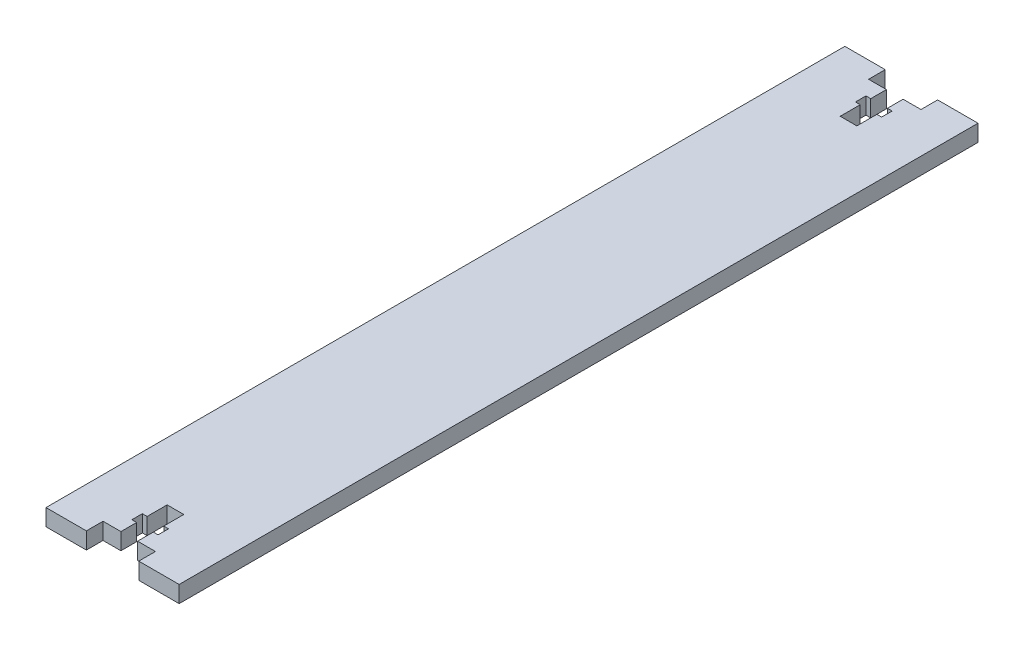
ISO-10303-21;
HEADER;
FILE_DESCRIPTION(('STEP AP214'),'2;1');
FILE_NAME('part.step','',(''),(''),'','','');
FILE_SCHEMA(('AUTOMOTIVE_DESIGN { 1 0 10303 214 1 1 1 1 }'));
ENDSEC;
DATA;
#1=APPLICATION_CONTEXT('core data for automotive mechanical design processes');
#2=APPLICATION_PROTOCOL_DEFINITION('international standard','automotive_design',2000,#1);
#3=PRODUCT_CONTEXT('',#1,'mechanical');
#4=PRODUCT('Part','Part','',(#3));
#5=PRODUCT_RELATED_PRODUCT_CATEGORY('part','',(#4));
#6=PRODUCT_DEFINITION_FORMATION('','',#4);
#7=PRODUCT_DEFINITION_CONTEXT('part definition',#1,'design');
#8=PRODUCT_DEFINITION('design','',#6,#7);
#9=PRODUCT_DEFINITION_SHAPE('','',#8);
#10=(LENGTH_UNIT() NAMED_UNIT(*) SI_UNIT(.MILLI.,.METRE.));
#11=(NAMED_UNIT(*) PLANE_ANGLE_UNIT() SI_UNIT($,.RADIAN.));
#12=(NAMED_UNIT(*) SI_UNIT($,.STERADIAN.) SOLID_ANGLE_UNIT());
#13=UNCERTAINTY_MEASURE_WITH_UNIT(LENGTH_MEASURE(1.E-05),#10,'distance_accuracy_value','');
#14=(GEOMETRIC_REPRESENTATION_CONTEXT(3) GLOBAL_UNCERTAINTY_ASSIGNED_CONTEXT((#13)) GLOBAL_UNIT_ASSIGNED_CONTEXT((#10,
#11,#12)) REPRESENTATION_CONTEXT('',''));
#15=CARTESIAN_POINT('',(0.,0.,0.));
#16=DIRECTION('',(0.,0.,1.));
#17=DIRECTION('',(1.,0.,0.));
#18=AXIS2_PLACEMENT_3D('',#15,#16,#17);
#19=CARTESIAN_POINT('',(12.7,3.18,76.2));
#20=DIRECTION('',(0.,0.,-1.));
#21=DIRECTION('',(-1.,0.,0.));
#22=AXIS2_PLACEMENT_3D('',#19,#20,#21);
#23=PLANE('',#22);
#24=DIRECTION('',(0.,1.,0.));
#25=VECTOR('',#24,1.);
#26=CARTESIAN_POINT('',(-4.99999999999998,0.,76.2));
#27=LINE('',#26,#25);
#28=CARTESIAN_POINT('',(-4.99999999999998,0.,76.2));
#29=VERTEX_POINT('',#28);
#30=CARTESIAN_POINT('',(-4.99999999999998,3.18,76.2));
#31=VERTEX_POINT('',#30);
#32=EDGE_CURVE('E570',#29,#31,#27,.T.);
#33=ORIENTED_EDGE('',*,*,#32,.T.);
#34=DIRECTION('',(1.,0.,0.));
#35=VECTOR('',#34,1.);
#36=CARTESIAN_POINT('',(12.7,3.18,76.2));
#37=LINE('',#36,#35);
#38=CARTESIAN_POINT('',(-12.7,3.18,76.2));
#39=VERTEX_POINT('',#38);
#40=EDGE_CURVE('E709',#39,#31,#37,.T.);
#41=ORIENTED_EDGE('',*,*,#40,.F.);
#42=DIRECTION('',(0.,-1.,0.));
#43=VECTOR('',#42,1.);
#44=CARTESIAN_POINT('',(-12.7,3.18,76.2));
#45=LINE('',#44,#43);
#46=CARTESIAN_POINT('',(-12.7,0.,76.2));
#47=VERTEX_POINT('',#46);
#48=EDGE_CURVE('E12',#39,#47,#45,.T.);
#49=ORIENTED_EDGE('',*,*,#48,.T.);
#50=DIRECTION('',(1.,0.,0.));
#51=VECTOR('',#50,1.);
#52=CARTESIAN_POINT('',(12.7,0.,76.2));
#53=LINE('',#52,#51);
#54=EDGE_CURVE('E726',#47,#29,#53,.T.);
#55=ORIENTED_EDGE('',*,*,#54,.T.);
#56=EDGE_LOOP('',(#33,#41,#49,#55));
#57=FACE_BOUND('',#56,.T.);
#58=ADVANCED_FACE('F138',(#57),#23,.F.);
#59=CARTESIAN_POINT('',(12.7,3.18,-76.2));
#60=DIRECTION('',(0.,0.,1.));
#61=DIRECTION('',(1.,0.,0.));
#62=AXIS2_PLACEMENT_3D('',#59,#60,#61);
#63=PLANE('',#62);
#64=DIRECTION('',(0.,1.,0.));
#65=VECTOR('',#64,1.);
#66=CARTESIAN_POINT('',(4.99999999999999,0.,-76.2));
#67=LINE('',#66,#65);
#68=CARTESIAN_POINT('',(4.99999999999999,0.,-76.2));
#69=VERTEX_POINT('',#68);
#70=CARTESIAN_POINT('',(4.99999999999999,3.18,-76.2));
#71=VERTEX_POINT('',#70);
#72=EDGE_CURVE('E526',#69,#71,#67,.T.);
#73=ORIENTED_EDGE('',*,*,#72,.T.);
#74=DIRECTION('',(-1.,0.,0.));
#75=VECTOR('',#74,1.);
#76=CARTESIAN_POINT('',(12.7,3.18,-76.2));
#77=LINE('',#76,#75);
#78=CARTESIAN_POINT('',(12.7,3.18,-76.2));
#79=VERTEX_POINT('',#78);
#80=EDGE_CURVE('E717',#79,#71,#77,.T.);
#81=ORIENTED_EDGE('',*,*,#80,.F.);
#82=DIRECTION('',(0.,-1.,0.));
#83=VECTOR('',#82,1.);
#84=CARTESIAN_POINT('',(12.7,3.18,-76.2));
#85=LINE('',#84,#83);
#86=CARTESIAN_POINT('',(12.7,0.,-76.2));
#87=VERTEX_POINT('',#86);
#88=EDGE_CURVE('E740',#79,#87,#85,.T.);
#89=ORIENTED_EDGE('',*,*,#88,.T.);
#90=DIRECTION('',(-1.,0.,0.));
#91=VECTOR('',#90,1.);
#92=CARTESIAN_POINT('',(12.7,0.,-76.2));
#93=LINE('',#92,#91);
#94=EDGE_CURVE('E708',#87,#69,#93,.T.);
#95=ORIENTED_EDGE('',*,*,#94,.T.);
#96=EDGE_LOOP('',(#73,#81,#89,#95));
#97=FACE_BOUND('',#96,.T.);
#98=ADVANCED_FACE('F757',(#97),#63,.F.);
#99=CARTESIAN_POINT('',(-12.7,3.18,-76.2));
#100=DIRECTION('',(1.,0.,0.));
#101=DIRECTION('',(0.,0.,-1.));
#102=AXIS2_PLACEMENT_3D('',#99,#100,#101);
#103=PLANE('',#102);
#104=DIRECTION('',(0.,0.,1.));
#105=VECTOR('',#104,1.);
#106=CARTESIAN_POINT('',(-12.7,0.,-76.2));
#107=LINE('',#106,#105);
#108=CARTESIAN_POINT('',(-12.7,0.,-76.2));
#109=VERTEX_POINT('',#108);
#110=EDGE_CURVE('E504',#109,#47,#107,.T.);
#111=ORIENTED_EDGE('',*,*,#110,.T.);
#112=ORIENTED_EDGE('',*,*,#48,.F.);
#113=DIRECTION('',(0.,0.,1.));
#114=VECTOR('',#113,1.);
#115=CARTESIAN_POINT('',(-12.7,3.18,-76.2));
#116=LINE('',#115,#114);
#117=CARTESIAN_POINT('',(-12.7,3.18,-76.2));
#118=VERTEX_POINT('',#117);
#119=EDGE_CURVE('E703',#118,#39,#116,.T.);
#120=ORIENTED_EDGE('',*,*,#119,.F.);
#121=DIRECTION('',(0.,-1.,0.));
#122=VECTOR('',#121,1.);
#123=CARTESIAN_POINT('',(-12.7,3.18,-76.2));
#124=LINE('',#123,#122);
#125=EDGE_CURVE('E721',#118,#109,#124,.T.);
#126=ORIENTED_EDGE('',*,*,#125,.T.);
#127=EDGE_LOOP('',(#111,#112,#120,#126));
#128=FACE_BOUND('',#127,.T.);
#129=ADVANCED_FACE('F140',(#128),#103,.F.);
#130=CARTESIAN_POINT('',(5.00000000000001,3.18,76.2));
#131=VERTEX_POINT('',#130);
#132=CARTESIAN_POINT('',(12.7,3.18,76.2));
#133=VERTEX_POINT('',#132);
#134=EDGE_CURVE('E707',#131,#133,#37,.T.);
#135=ORIENTED_EDGE('',*,*,#134,.F.);
#136=DIRECTION('',(0.,1.,0.));
#137=VECTOR('',#136,1.);
#138=CARTESIAN_POINT('',(5.00000000000001,0.,76.2));
#139=LINE('',#138,#137);
#140=CARTESIAN_POINT('',(5.00000000000001,0.,76.2));
#141=VERTEX_POINT('',#140);
#142=EDGE_CURVE('E567',#141,#131,#139,.T.);
#143=ORIENTED_EDGE('',*,*,#142,.F.);
#144=CARTESIAN_POINT('',(12.7,0.,76.2));
#145=VERTEX_POINT('',#144);
#146=EDGE_CURVE('E725',#141,#145,#53,.T.);
#147=ORIENTED_EDGE('',*,*,#146,.T.);
#148=DIRECTION('',(0.,-1.,0.));
#149=VECTOR('',#148,1.);
#150=CARTESIAN_POINT('',(12.7,3.18,76.2));
#151=LINE('',#150,#149);
#152=EDGE_CURVE('E147',#133,#145,#151,.T.);
#153=ORIENTED_EDGE('',*,*,#152,.F.);
#154=EDGE_LOOP('',(#135,#143,#147,#153));
#155=FACE_BOUND('',#154,.T.);
#156=ADVANCED_FACE('F768',(#155),#23,.F.);
#157=CARTESIAN_POINT('',(12.7,3.18,-76.2));
#158=DIRECTION('',(-1.,0.,0.));
#159=DIRECTION('',(0.,0.,1.));
#160=AXIS2_PLACEMENT_3D('',#157,#158,#159);
#161=PLANE('',#160);
#162=DIRECTION('',(0.,0.,-1.));
#163=VECTOR('',#162,1.);
#164=CARTESIAN_POINT('',(12.7,0.,-76.2));
#165=LINE('',#164,#163);
#166=EDGE_CURVE('E730',#145,#87,#165,.T.);
#167=ORIENTED_EDGE('',*,*,#166,.T.);
#168=ORIENTED_EDGE('',*,*,#88,.F.);
#169=DIRECTION('',(0.,0.,-1.));
#170=VECTOR('',#169,1.);
#171=CARTESIAN_POINT('',(12.7,3.18,-76.2));
#172=LINE('',#171,#170);
#173=EDGE_CURVE('E713',#133,#79,#172,.T.);
#174=ORIENTED_EDGE('',*,*,#173,.F.);
#175=ORIENTED_EDGE('',*,*,#152,.T.);
#176=EDGE_LOOP('',(#167,#168,#174,#175));
#177=FACE_BOUND('',#176,.T.);
#178=ADVANCED_FACE('F749',(#177),#161,.F.);
#179=CARTESIAN_POINT('',(-5.,3.18,-76.2));
#180=VERTEX_POINT('',#179);
#181=EDGE_CURVE('E716',#180,#118,#77,.T.);
#182=ORIENTED_EDGE('',*,*,#181,.F.);
#183=DIRECTION('',(0.,1.,0.));
#184=VECTOR('',#183,1.);
#185=CARTESIAN_POINT('',(-5.,0.,-76.2));
#186=LINE('',#185,#184);
#187=CARTESIAN_POINT('',(-5.,0.,-76.2));
#188=VERTEX_POINT('',#187);
#189=EDGE_CURVE('E523',#188,#180,#186,.T.);
#190=ORIENTED_EDGE('',*,*,#189,.F.);
#191=EDGE_CURVE('E733',#188,#109,#93,.T.);
#192=ORIENTED_EDGE('',*,*,#191,.T.);
#193=ORIENTED_EDGE('',*,*,#125,.F.);
#194=EDGE_LOOP('',(#182,#190,#192,#193));
#195=FACE_BOUND('',#194,.T.);
#196=ADVANCED_FACE('F844',(#195),#63,.F.);
#197=CARTESIAN_POINT('',(0.,3.18,0.));
#198=DIRECTION('',(0.,-1.,0.));
#199=DIRECTION('',(0.,0.,-1.));
#200=AXIS2_PLACEMENT_3D('',#197,#198,#199);
#201=PLANE('',#200);
#202=DIRECTION('',(1.,0.,0.));
#203=VECTOR('',#202,1.);
#204=CARTESIAN_POINT('',(0.,3.18,-73.02));
#205=LINE('',#204,#203);
#206=CARTESIAN_POINT('',(-5.,3.18,-73.02));
#207=VERTEX_POINT('',#206);
#208=CARTESIAN_POINT('',(-1.59000000000001,3.18,-73.02));
#209=VERTEX_POINT('',#208);
#210=EDGE_CURVE('E478',#207,#209,#205,.T.);
#211=ORIENTED_EDGE('',*,*,#210,.F.);
#212=DIRECTION('',(0.,0.,1.));
#213=VECTOR('',#212,1.);
#214=CARTESIAN_POINT('',(-5.,3.18,0.));
#215=LINE('',#214,#213);
#216=EDGE_CURVE('E474',#180,#207,#215,.T.);
#217=ORIENTED_EDGE('',*,*,#216,.F.);
#218=ORIENTED_EDGE('',*,*,#181,.T.);
#219=ORIENTED_EDGE('',*,*,#119,.T.);
#220=ORIENTED_EDGE('',*,*,#40,.T.);
#221=DIRECTION('',(0.,0.,-1.));
#222=VECTOR('',#221,1.);
#223=CARTESIAN_POINT('',(-4.99999999999998,3.18,76.2));
#224=LINE('',#223,#222);
#225=CARTESIAN_POINT('',(-4.99999999999998,3.18,73.02));
#226=VERTEX_POINT('',#225);
#227=EDGE_CURVE('E623',#31,#226,#224,.T.);
#228=ORIENTED_EDGE('',*,*,#227,.T.);
#229=DIRECTION('',(1.,0.,0.));
#230=VECTOR('',#229,1.);
#231=CARTESIAN_POINT('',(-4.99999999999998,3.18,73.02));
#232=LINE('',#231,#230);
#233=CARTESIAN_POINT('',(-1.58999999999999,3.18,73.02));
#234=VERTEX_POINT('',#233);
#235=EDGE_CURVE('E619',#226,#234,#232,.T.);
#236=ORIENTED_EDGE('',*,*,#235,.T.);
#237=DIRECTION('',(0.,0.,-1.));
#238=VECTOR('',#237,1.);
#239=CARTESIAN_POINT('',(-1.58999999999999,3.18,73.02));
#240=LINE('',#239,#238);
#241=CARTESIAN_POINT('',(-1.58999999999999,3.18,70.02));
#242=VERTEX_POINT('',#241);
#243=EDGE_CURVE('E615',#234,#242,#240,.T.);
#244=ORIENTED_EDGE('',*,*,#243,.T.);
#245=DIRECTION('',(1.,0.,0.));
#246=VECTOR('',#245,1.);
#247=CARTESIAN_POINT('',(-2.49999999999999,3.18,70.02));
#248=LINE('',#247,#246);
#249=CARTESIAN_POINT('',(-2.49999999999999,3.18,70.02));
#250=VERTEX_POINT('',#249);
#251=EDGE_CURVE('E611',#250,#242,#248,.T.);
#252=ORIENTED_EDGE('',*,*,#251,.F.);
#253=DIRECTION('',(0.,0.,-1.));
#254=VECTOR('',#253,1.);
#255=CARTESIAN_POINT('',(-2.49999999999999,3.18,70.02));
#256=LINE('',#255,#254);
#257=CARTESIAN_POINT('',(-2.49999999999999,3.18,68.02));
#258=VERTEX_POINT('',#257);
#259=EDGE_CURVE('E607',#250,#258,#256,.T.);
#260=ORIENTED_EDGE('',*,*,#259,.T.);
#261=DIRECTION('',(1.,0.,0.));
#262=VECTOR('',#261,1.);
#263=CARTESIAN_POINT('',(-2.49999999999999,3.18,68.02));
#264=LINE('',#263,#262);
#265=CARTESIAN_POINT('',(-1.58999999999999,3.18,68.02));
#266=VERTEX_POINT('',#265);
#267=EDGE_CURVE('E603',#258,#266,#264,.T.);
#268=ORIENTED_EDGE('',*,*,#267,.T.);
#269=DIRECTION('',(0.,0.,-1.));
#270=VECTOR('',#269,1.);
#271=CARTESIAN_POINT('',(-1.58999999999999,3.18,68.02));
#272=LINE('',#271,#270);
#273=CARTESIAN_POINT('',(-1.58999999999999,3.18,64.2));
#274=VERTEX_POINT('',#273);
#275=EDGE_CURVE('E598',#266,#274,#272,.T.);
#276=ORIENTED_EDGE('',*,*,#275,.T.);
#277=DIRECTION('',(-1.,0.,0.));
#278=VECTOR('',#277,1.);
#279=CARTESIAN_POINT('',(0.,3.18,64.2));
#280=LINE('',#279,#278);
#281=CARTESIAN_POINT('',(1.59000000000001,3.18,64.2));
#282=VERTEX_POINT('',#281);
#283=EDGE_CURVE('E595',#282,#274,#280,.T.);
#284=ORIENTED_EDGE('',*,*,#283,.F.);
#285=DIRECTION('',(0.,0.,-1.));
#286=VECTOR('',#285,1.);
#287=CARTESIAN_POINT('',(1.59000000000001,3.18,68.02));
#288=LINE('',#287,#286);
#289=CARTESIAN_POINT('',(1.59000000000001,3.18,68.02));
#290=VERTEX_POINT('',#289);
#291=EDGE_CURVE('E448',#290,#282,#288,.T.);
#292=ORIENTED_EDGE('',*,*,#291,.F.);
#293=DIRECTION('',(1.,0.,0.));
#294=VECTOR('',#293,1.);
#295=CARTESIAN_POINT('',(1.59000000000001,3.18,68.02));
#296=LINE('',#295,#294);
#297=CARTESIAN_POINT('',(2.50000000000001,3.18,68.02));
#298=VERTEX_POINT('',#297);
#299=EDGE_CURVE('E647',#290,#298,#296,.T.);
#300=ORIENTED_EDGE('',*,*,#299,.T.);
#301=DIRECTION('',(0.,0.,-1.));
#302=VECTOR('',#301,1.);
#303=CARTESIAN_POINT('',(2.50000000000001,3.18,70.02));
#304=LINE('',#303,#302);
#305=CARTESIAN_POINT('',(2.50000000000001,3.18,70.02));
#306=VERTEX_POINT('',#305);
#307=EDGE_CURVE('E643',#306,#298,#304,.T.);
#308=ORIENTED_EDGE('',*,*,#307,.F.);
#309=DIRECTION('',(1.,0.,0.));
#310=VECTOR('',#309,1.);
#311=CARTESIAN_POINT('',(1.59000000000001,3.18,70.02));
#312=LINE('',#311,#310);
#313=CARTESIAN_POINT('',(1.59000000000001,3.18,70.02));
#314=VERTEX_POINT('',#313);
#315=EDGE_CURVE('E639',#314,#306,#312,.T.);
#316=ORIENTED_EDGE('',*,*,#315,.F.);
#317=DIRECTION('',(0.,0.,-1.));
#318=VECTOR('',#317,1.);
#319=CARTESIAN_POINT('',(1.59000000000001,3.18,73.02));
#320=LINE('',#319,#318);
#321=CARTESIAN_POINT('',(1.59000000000001,3.18,73.02));
#322=VERTEX_POINT('',#321);
#323=EDGE_CURVE('E635',#322,#314,#320,.T.);
#324=ORIENTED_EDGE('',*,*,#323,.F.);
#325=DIRECTION('',(1.,0.,0.));
#326=VECTOR('',#325,1.);
#327=CARTESIAN_POINT('',(1.59000000000001,3.18,73.02));
#328=LINE('',#327,#326);
#329=CARTESIAN_POINT('',(5.00000000000001,3.18,73.02));
#330=VERTEX_POINT('',#329);
#331=EDGE_CURVE('E631',#322,#330,#328,.T.);
#332=ORIENTED_EDGE('',*,*,#331,.T.);
#333=DIRECTION('',(0.,0.,-1.));
#334=VECTOR('',#333,1.);
#335=CARTESIAN_POINT('',(5.00000000000001,3.18,76.2));
#336=LINE('',#335,#334);
#337=EDGE_CURVE('E627',#131,#330,#336,.T.);
#338=ORIENTED_EDGE('',*,*,#337,.F.);
#339=ORIENTED_EDGE('',*,*,#134,.T.);
#340=ORIENTED_EDGE('',*,*,#173,.T.);
#341=ORIENTED_EDGE('',*,*,#80,.T.);
#342=DIRECTION('',(0.,0.,1.));
#343=VECTOR('',#342,1.);
#344=CARTESIAN_POINT('',(5.00000000000024,3.18,0.));
#345=LINE('',#344,#343);
#346=CARTESIAN_POINT('',(5.,3.18,-73.02));
#347=VERTEX_POINT('',#346);
#348=EDGE_CURVE('E470',#71,#347,#345,.T.);
#349=ORIENTED_EDGE('',*,*,#348,.T.);
#350=DIRECTION('',(1.,0.,0.));
#351=VECTOR('',#350,1.);
#352=CARTESIAN_POINT('',(0.,3.18,-73.02));
#353=LINE('',#352,#351);
#354=CARTESIAN_POINT('',(1.58999999999999,3.18,-73.02));
#355=VERTEX_POINT('',#354);
#356=EDGE_CURVE('E466',#355,#347,#353,.T.);
#357=ORIENTED_EDGE('',*,*,#356,.F.);
#358=DIRECTION('',(0.,0.,1.));
#359=VECTOR('',#358,1.);
#360=CARTESIAN_POINT('',(1.58999999999999,3.18,0.));
#361=LINE('',#360,#359);
#362=CARTESIAN_POINT('',(1.58999999999999,3.18,-70.02));
#363=VERTEX_POINT('',#362);
#364=EDGE_CURVE('E462',#355,#363,#361,.T.);
#365=ORIENTED_EDGE('',*,*,#364,.T.);
#366=DIRECTION('',(1.,0.,0.));
#367=VECTOR('',#366,1.);
#368=CARTESIAN_POINT('',(0.,3.18,-70.02));
#369=LINE('',#368,#367);
#370=CARTESIAN_POINT('',(2.49999999999999,3.18,-70.02));
#371=VERTEX_POINT('',#370);
#372=EDGE_CURVE('E458',#363,#371,#369,.T.);
#373=ORIENTED_EDGE('',*,*,#372,.T.);
#374=DIRECTION('',(0.,0.,1.));
#375=VECTOR('',#374,1.);
#376=CARTESIAN_POINT('',(2.5000000000001,3.18,0.));
#377=LINE('',#376,#375);
#378=CARTESIAN_POINT('',(2.5,3.18,-68.02));
#379=VERTEX_POINT('',#378);
#380=EDGE_CURVE('E454',#371,#379,#377,.T.);
#381=ORIENTED_EDGE('',*,*,#380,.T.);
#382=DIRECTION('',(1.,0.,0.));
#383=VECTOR('',#382,1.);
#384=CARTESIAN_POINT('',(-1.03732651284345E-12,3.18,-68.02));
#385=LINE('',#384,#383);
#386=CARTESIAN_POINT('',(1.58999999999999,3.18,-68.02));
#387=VERTEX_POINT('',#386);
#388=EDGE_CURVE('E451',#387,#379,#385,.T.);
#389=ORIENTED_EDGE('',*,*,#388,.F.);
#390=DIRECTION('',(0.,0.,1.));
#391=VECTOR('',#390,1.);
#392=CARTESIAN_POINT('',(1.59,3.18,0.));
#393=LINE('',#392,#391);
#394=CARTESIAN_POINT('',(1.59,3.18,-64.2));
#395=VERTEX_POINT('',#394);
#396=EDGE_CURVE('E378',#387,#395,#393,.T.);
#397=ORIENTED_EDGE('',*,*,#396,.T.);
#398=DIRECTION('',(-1.,0.,0.));
#399=VECTOR('',#398,1.);
#400=CARTESIAN_POINT('',(0.,3.18,-64.2));
#401=LINE('',#400,#399);
#402=CARTESIAN_POINT('',(-1.59,3.18,-64.2));
#403=VERTEX_POINT('',#402);
#404=EDGE_CURVE('E444',#395,#403,#401,.T.);
#405=ORIENTED_EDGE('',*,*,#404,.T.);
#406=DIRECTION('',(0.,0.,1.));
#407=VECTOR('',#406,1.);
#408=CARTESIAN_POINT('',(-1.59,3.18,0.));
#409=LINE('',#408,#407);
#410=CARTESIAN_POINT('',(-1.59000000000001,3.18,-68.02));
#411=VERTEX_POINT('',#410);
#412=EDGE_CURVE('E401',#411,#403,#409,.T.);
#413=ORIENTED_EDGE('',*,*,#412,.F.);
#414=DIRECTION('',(1.,0.,0.));
#415=VECTOR('',#414,1.);
#416=CARTESIAN_POINT('',(1.03732651284345E-12,3.18,-68.02));
#417=LINE('',#416,#415);
#418=CARTESIAN_POINT('',(-2.5,3.18,-68.02));
#419=VERTEX_POINT('',#418);
#420=EDGE_CURVE('E494',#419,#411,#417,.T.);
#421=ORIENTED_EDGE('',*,*,#420,.F.);
#422=DIRECTION('',(0.,0.,1.));
#423=VECTOR('',#422,1.);
#424=CARTESIAN_POINT('',(-2.50000000000002,3.18,0.));
#425=LINE('',#424,#423);
#426=CARTESIAN_POINT('',(-2.5,3.18,-70.02));
#427=VERTEX_POINT('',#426);
#428=EDGE_CURVE('E490',#427,#419,#425,.T.);
#429=ORIENTED_EDGE('',*,*,#428,.F.);
#430=DIRECTION('',(1.,0.,0.));
#431=VECTOR('',#430,1.);
#432=CARTESIAN_POINT('',(0.,3.18,-70.02));
#433=LINE('',#432,#431);
#434=CARTESIAN_POINT('',(-1.59000000000001,3.18,-70.02));
#435=VERTEX_POINT('',#434);
#436=EDGE_CURVE('E486',#427,#435,#433,.T.);
#437=ORIENTED_EDGE('',*,*,#436,.T.);
#438=DIRECTION('',(0.,0.,1.));
#439=VECTOR('',#438,1.);
#440=CARTESIAN_POINT('',(-1.59,3.18,0.));
#441=LINE('',#440,#439);
#442=EDGE_CURVE('E482',#209,#435,#441,.T.);
#443=ORIENTED_EDGE('',*,*,#442,.F.);
#444=EDGE_LOOP('',(#211,#217,#218,#219,#220,#228,#236,#244,#252,#260,#268,#276,#284,#292,#300,
#308,#316,#324,#332,#338,#339,#340,#341,#349,#357,#365,#373,#381,#389,#397,#405,#413,#421,#429,
#437,#443));
#445=FACE_BOUND('',#444,.T.);
#446=ADVANCED_FACE('F761',(#445),#201,.F.);
#447=CARTESIAN_POINT('',(0.,0.,0.));
#448=DIRECTION('',(0.,-1.,0.));
#449=DIRECTION('',(0.,0.,-1.));
#450=AXIS2_PLACEMENT_3D('',#447,#448,#449);
#451=PLANE('',#450);
#452=DIRECTION('',(0.,0.,1.));
#453=VECTOR('',#452,1.);
#454=CARTESIAN_POINT('',(-5.,0.,0.));
#455=LINE('',#454,#453);
#456=CARTESIAN_POINT('',(-5.,0.,-73.02));
#457=VERTEX_POINT('',#456);
#458=EDGE_CURVE('E419',#188,#457,#455,.T.);
#459=ORIENTED_EDGE('',*,*,#458,.T.);
#460=DIRECTION('',(1.,0.,0.));
#461=VECTOR('',#460,1.);
#462=CARTESIAN_POINT('',(0.,0.,-73.02));
#463=LINE('',#462,#461);
#464=CARTESIAN_POINT('',(-1.59000000000001,0.,-73.02));
#465=VERTEX_POINT('',#464);
#466=EDGE_CURVE('E422',#457,#465,#463,.T.);
#467=ORIENTED_EDGE('',*,*,#466,.T.);
#468=DIRECTION('',(0.,0.,1.));
#469=VECTOR('',#468,1.);
#470=CARTESIAN_POINT('',(-1.59,0.,0.));
#471=LINE('',#470,#469);
#472=CARTESIAN_POINT('',(-1.59000000000001,0.,-70.02));
#473=VERTEX_POINT('',#472);
#474=EDGE_CURVE('E426',#465,#473,#471,.T.);
#475=ORIENTED_EDGE('',*,*,#474,.T.);
#476=DIRECTION('',(1.,0.,0.));
#477=VECTOR('',#476,1.);
#478=CARTESIAN_POINT('',(0.,0.,-70.02));
#479=LINE('',#478,#477);
#480=CARTESIAN_POINT('',(-2.5,0.,-70.02));
#481=VERTEX_POINT('',#480);
#482=EDGE_CURVE('E430',#481,#473,#479,.T.);
#483=ORIENTED_EDGE('',*,*,#482,.F.);
#484=DIRECTION('',(0.,0.,1.));
#485=VECTOR('',#484,1.);
#486=CARTESIAN_POINT('',(-2.50000000000002,0.,0.));
#487=LINE('',#486,#485);
#488=CARTESIAN_POINT('',(-2.5,0.,-68.02));
#489=VERTEX_POINT('',#488);
#490=EDGE_CURVE('E433',#481,#489,#487,.T.);
#491=ORIENTED_EDGE('',*,*,#490,.T.);
#492=DIRECTION('',(1.,0.,0.));
#493=VECTOR('',#492,1.);
#494=CARTESIAN_POINT('',(1.03732651284345E-12,0.,-68.02));
#495=LINE('',#494,#493);
#496=CARTESIAN_POINT('',(-1.59000000000001,0.,-68.02));
#497=VERTEX_POINT('',#496);
#498=EDGE_CURVE('E437',#489,#497,#495,.T.);
#499=ORIENTED_EDGE('',*,*,#498,.T.);
#500=DIRECTION('',(0.,0.,1.));
#501=VECTOR('',#500,1.);
#502=CARTESIAN_POINT('',(-1.59,0.,0.));
#503=LINE('',#502,#501);
#504=CARTESIAN_POINT('',(-1.59,0.,-64.2));
#505=VERTEX_POINT('',#504);
#506=EDGE_CURVE('E441',#497,#505,#503,.T.);
#507=ORIENTED_EDGE('',*,*,#506,.T.);
#508=DIRECTION('',(-1.,0.,0.));
#509=VECTOR('',#508,1.);
#510=CARTESIAN_POINT('',(0.,0.,-64.2));
#511=LINE('',#510,#509);
#512=CARTESIAN_POINT('',(1.59,0.,-64.2));
#513=VERTEX_POINT('',#512);
#514=EDGE_CURVE('E397',#513,#505,#511,.T.);
#515=ORIENTED_EDGE('',*,*,#514,.F.);
#516=DIRECTION('',(0.,0.,1.));
#517=VECTOR('',#516,1.);
#518=CARTESIAN_POINT('',(1.59,0.,0.));
#519=LINE('',#518,#517);
#520=CARTESIAN_POINT('',(1.58999999999999,0.,-68.02));
#521=VERTEX_POINT('',#520);
#522=EDGE_CURVE('E375',#521,#513,#519,.T.);
#523=ORIENTED_EDGE('',*,*,#522,.F.);
#524=DIRECTION('',(1.,0.,0.));
#525=VECTOR('',#524,1.);
#526=CARTESIAN_POINT('',(-1.03732651284345E-12,0.,-68.02));
#527=LINE('',#526,#525);
#528=CARTESIAN_POINT('',(2.5,0.,-68.02));
#529=VERTEX_POINT('',#528);
#530=EDGE_CURVE('E387',#521,#529,#527,.T.);
#531=ORIENTED_EDGE('',*,*,#530,.T.);
#532=DIRECTION('',(0.,0.,1.));
#533=VECTOR('',#532,1.);
#534=CARTESIAN_POINT('',(2.5000000000001,0.,0.));
#535=LINE('',#534,#533);
#536=CARTESIAN_POINT('',(2.49999999999999,0.,-70.02));
#537=VERTEX_POINT('',#536);
#538=EDGE_CURVE('E392',#537,#529,#535,.T.);
#539=ORIENTED_EDGE('',*,*,#538,.F.);
#540=DIRECTION('',(1.,0.,0.));
#541=VECTOR('',#540,1.);
#542=CARTESIAN_POINT('',(0.,0.,-70.02));
#543=LINE('',#542,#541);
#544=CARTESIAN_POINT('',(1.58999999999999,0.,-70.02));
#545=VERTEX_POINT('',#544);
#546=EDGE_CURVE('E406',#545,#537,#543,.T.);
#547=ORIENTED_EDGE('',*,*,#546,.F.);
#548=DIRECTION('',(0.,0.,1.));
#549=VECTOR('',#548,1.);
#550=CARTESIAN_POINT('',(1.58999999999999,0.,0.));
#551=LINE('',#550,#549);
#552=CARTESIAN_POINT('',(1.58999999999999,0.,-73.02));
#553=VERTEX_POINT('',#552);
#554=EDGE_CURVE('E409',#553,#545,#551,.T.);
#555=ORIENTED_EDGE('',*,*,#554,.F.);
#556=DIRECTION('',(1.,0.,0.));
#557=VECTOR('',#556,1.);
#558=CARTESIAN_POINT('',(0.,0.,-73.02));
#559=LINE('',#558,#557);
#560=CARTESIAN_POINT('',(5.,0.,-73.02));
#561=VERTEX_POINT('',#560);
#562=EDGE_CURVE('E412',#553,#561,#559,.T.);
#563=ORIENTED_EDGE('',*,*,#562,.T.);
#564=DIRECTION('',(0.,0.,1.));
#565=VECTOR('',#564,1.);
#566=CARTESIAN_POINT('',(5.00000000000024,0.,0.));
#567=LINE('',#566,#565);
#568=EDGE_CURVE('E416',#69,#561,#567,.T.);
#569=ORIENTED_EDGE('',*,*,#568,.F.);
#570=ORIENTED_EDGE('',*,*,#94,.F.);
#571=ORIENTED_EDGE('',*,*,#166,.F.);
#572=ORIENTED_EDGE('',*,*,#146,.F.);
#573=DIRECTION('',(0.,0.,-1.));
#574=VECTOR('',#573,1.);
#575=CARTESIAN_POINT('',(5.00000000000001,0.,76.2));
#576=LINE('',#575,#574);
#577=CARTESIAN_POINT('',(5.00000000000001,0.,73.02));
#578=VERTEX_POINT('',#577);
#579=EDGE_CURVE('E675',#141,#578,#576,.T.);
#580=ORIENTED_EDGE('',*,*,#579,.T.);
#581=DIRECTION('',(1.,0.,0.));
#582=VECTOR('',#581,1.);
#583=CARTESIAN_POINT('',(1.59000000000001,0.,73.02));
#584=LINE('',#583,#582);
#585=CARTESIAN_POINT('',(1.59000000000001,0.,73.02));
#586=VERTEX_POINT('',#585);
#587=EDGE_CURVE('E679',#586,#578,#584,.T.);
#588=ORIENTED_EDGE('',*,*,#587,.F.);
#589=DIRECTION('',(0.,0.,-1.));
#590=VECTOR('',#589,1.);
#591=CARTESIAN_POINT('',(1.59000000000001,0.,73.02));
#592=LINE('',#591,#590);
#593=CARTESIAN_POINT('',(1.59000000000001,0.,70.02));
#594=VERTEX_POINT('',#593);
#595=EDGE_CURVE('E682',#586,#594,#592,.T.);
#596=ORIENTED_EDGE('',*,*,#595,.T.);
#597=DIRECTION('',(1.,0.,0.));
#598=VECTOR('',#597,1.);
#599=CARTESIAN_POINT('',(1.59000000000001,0.,70.02));
#600=LINE('',#599,#598);
#601=CARTESIAN_POINT('',(2.50000000000001,0.,70.02));
#602=VERTEX_POINT('',#601);
#603=EDGE_CURVE('E686',#594,#602,#600,.T.);
#604=ORIENTED_EDGE('',*,*,#603,.T.);
#605=DIRECTION('',(0.,0.,-1.));
#606=VECTOR('',#605,1.);
#607=CARTESIAN_POINT('',(2.50000000000001,0.,70.02));
#608=LINE('',#607,#606);
#609=CARTESIAN_POINT('',(2.50000000000001,0.,68.02));
#610=VERTEX_POINT('',#609);
#611=EDGE_CURVE('E690',#602,#610,#608,.T.);
#612=ORIENTED_EDGE('',*,*,#611,.T.);
#613=DIRECTION('',(1.,0.,0.));
#614=VECTOR('',#613,1.);
#615=CARTESIAN_POINT('',(1.59000000000001,0.,68.02));
#616=LINE('',#615,#614);
#617=CARTESIAN_POINT('',(1.59000000000001,0.,68.02));
#618=VERTEX_POINT('',#617);
#619=EDGE_CURVE('E694',#618,#610,#616,.T.);
#620=ORIENTED_EDGE('',*,*,#619,.F.);
#621=DIRECTION('',(0.,0.,-1.));
#622=VECTOR('',#621,1.);
#623=CARTESIAN_POINT('',(1.59000000000001,0.,68.02));
#624=LINE('',#623,#622);
#625=CARTESIAN_POINT('',(1.59000000000001,0.,64.2));
#626=VERTEX_POINT('',#625);
#627=EDGE_CURVE('E697',#618,#626,#624,.T.);
#628=ORIENTED_EDGE('',*,*,#627,.T.);
#629=DIRECTION('',(1.,0.,0.));
#630=VECTOR('',#629,1.);
#631=CARTESIAN_POINT('',(0.,0.,64.2));
#632=LINE('',#631,#630);
#633=CARTESIAN_POINT('',(-1.58999999999999,0.,64.2));
#634=VERTEX_POINT('',#633);
#635=EDGE_CURVE('E599',#634,#626,#632,.T.);
#636=ORIENTED_EDGE('',*,*,#635,.F.);
#637=DIRECTION('',(0.,0.,-1.));
#638=VECTOR('',#637,1.);
#639=CARTESIAN_POINT('',(-1.58999999999999,0.,68.02));
#640=LINE('',#639,#638);
#641=CARTESIAN_POINT('',(-1.58999999999999,0.,68.02));
#642=VERTEX_POINT('',#641);
#643=EDGE_CURVE('E594',#642,#634,#640,.T.);
#644=ORIENTED_EDGE('',*,*,#643,.F.);
#645=DIRECTION('',(1.,0.,0.));
#646=VECTOR('',#645,1.);
#647=CARTESIAN_POINT('',(-2.49999999999999,0.,68.02));
#648=LINE('',#647,#646);
#649=CARTESIAN_POINT('',(-2.49999999999999,0.,68.02));
#650=VERTEX_POINT('',#649);
#651=EDGE_CURVE('E656',#650,#642,#648,.T.);
#652=ORIENTED_EDGE('',*,*,#651,.F.);
#653=DIRECTION('',(0.,0.,-1.));
#654=VECTOR('',#653,1.);
#655=CARTESIAN_POINT('',(-2.49999999999999,0.,70.02));
#656=LINE('',#655,#654);
#657=CARTESIAN_POINT('',(-2.49999999999999,0.,70.02));
#658=VERTEX_POINT('',#657);
#659=EDGE_CURVE('E659',#658,#650,#656,.T.);
#660=ORIENTED_EDGE('',*,*,#659,.F.);
#661=DIRECTION('',(1.,0.,0.));
#662=VECTOR('',#661,1.);
#663=CARTESIAN_POINT('',(-2.49999999999999,0.,70.02));
#664=LINE('',#663,#662);
#665=CARTESIAN_POINT('',(-1.58999999999999,0.,70.02));
#666=VERTEX_POINT('',#665);
#667=EDGE_CURVE('E662',#658,#666,#664,.T.);
#668=ORIENTED_EDGE('',*,*,#667,.T.);
#669=DIRECTION('',(0.,0.,-1.));
#670=VECTOR('',#669,1.);
#671=CARTESIAN_POINT('',(-1.58999999999999,0.,73.02));
#672=LINE('',#671,#670);
#673=CARTESIAN_POINT('',(-1.58999999999999,0.,73.02));
#674=VERTEX_POINT('',#673);
#675=EDGE_CURVE('E666',#674,#666,#672,.T.);
#676=ORIENTED_EDGE('',*,*,#675,.F.);
#677=DIRECTION('',(1.,0.,0.));
#678=VECTOR('',#677,1.);
#679=CARTESIAN_POINT('',(-4.99999999999998,0.,73.02));
#680=LINE('',#679,#678);
#681=CARTESIAN_POINT('',(-4.99999999999998,0.,73.02));
#682=VERTEX_POINT('',#681);
#683=EDGE_CURVE('E669',#682,#674,#680,.T.);
#684=ORIENTED_EDGE('',*,*,#683,.F.);
#685=DIRECTION('',(0.,0.,-1.));
#686=VECTOR('',#685,1.);
#687=CARTESIAN_POINT('',(-4.99999999999998,0.,76.2));
#688=LINE('',#687,#686);
#689=EDGE_CURVE('E672',#29,#682,#688,.T.);
#690=ORIENTED_EDGE('',*,*,#689,.F.);
#691=ORIENTED_EDGE('',*,*,#54,.F.);
#692=ORIENTED_EDGE('',*,*,#110,.F.);
#693=ORIENTED_EDGE('',*,*,#191,.F.);
#694=EDGE_LOOP('',(#459,#467,#475,#483,#491,#499,#507,#515,#523,#531,#539,#547,#555,#563,#569,
#570,#571,#572,#580,#588,#596,#604,#612,#620,#628,#636,#644,#652,#660,#668,#676,#684,#690,#691,
#692,#693));
#695=FACE_BOUND('',#694,.T.);
#696=ADVANCED_FACE('F395',(#695),#451,.T.);
#697=CARTESIAN_POINT('',(1.59000000000001,0.,68.02));
#698=DIRECTION('',(1.,0.,0.));
#699=DIRECTION('',(0.,0.,-1.));
#700=AXIS2_PLACEMENT_3D('',#697,#698,#699);
#701=PLANE('',#700);
#702=ORIENTED_EDGE('',*,*,#291,.T.);
#703=DIRECTION('',(0.,1.,0.));
#704=VECTOR('',#703,1.);
#705=CARTESIAN_POINT('',(1.59000000000001,0.,64.2));
#706=LINE('',#705,#704);
#707=EDGE_CURVE('E546',#626,#282,#706,.T.);
#708=ORIENTED_EDGE('',*,*,#707,.F.);
#709=ORIENTED_EDGE('',*,*,#627,.F.);
#710=DIRECTION('',(0.,1.,0.));
#711=VECTOR('',#710,1.);
#712=CARTESIAN_POINT('',(1.59000000000001,0.,68.02));
#713=LINE('',#712,#711);
#714=EDGE_CURVE('E549',#618,#290,#713,.T.);
#715=ORIENTED_EDGE('',*,*,#714,.T.);
#716=EDGE_LOOP('',(#702,#708,#709,#715));
#717=FACE_BOUND('',#716,.T.);
#718=ADVANCED_FACE('F797',(#717),#701,.F.);
#719=CARTESIAN_POINT('',(1.59000000000001,0.,68.02));
#720=DIRECTION('',(0.,0.,1.));
#721=DIRECTION('',(1.,0.,0.));
#722=AXIS2_PLACEMENT_3D('',#719,#720,#721);
#723=PLANE('',#722);
#724=ORIENTED_EDGE('',*,*,#299,.F.);
#725=ORIENTED_EDGE('',*,*,#714,.F.);
#726=ORIENTED_EDGE('',*,*,#619,.T.);
#727=DIRECTION('',(0.,1.,0.));
#728=VECTOR('',#727,1.);
#729=CARTESIAN_POINT('',(2.50000000000001,0.,68.02));
#730=LINE('',#729,#728);
#731=EDGE_CURVE('E552',#610,#298,#730,.T.);
#732=ORIENTED_EDGE('',*,*,#731,.T.);
#733=EDGE_LOOP('',(#724,#725,#726,#732));
#734=FACE_BOUND('',#733,.T.);
#735=ADVANCED_FACE('F792',(#734),#723,.T.);
#736=CARTESIAN_POINT('',(2.50000000000001,0.,70.02));
#737=DIRECTION('',(1.,0.,0.));
#738=DIRECTION('',(0.,0.,-1.));
#739=AXIS2_PLACEMENT_3D('',#736,#737,#738);
#740=PLANE('',#739);
#741=ORIENTED_EDGE('',*,*,#307,.T.);
#742=ORIENTED_EDGE('',*,*,#731,.F.);
#743=ORIENTED_EDGE('',*,*,#611,.F.);
#744=DIRECTION('',(0.,1.,0.));
#745=VECTOR('',#744,1.);
#746=CARTESIAN_POINT('',(2.50000000000001,0.,70.02));
#747=LINE('',#746,#745);
#748=EDGE_CURVE('E555',#602,#306,#747,.T.);
#749=ORIENTED_EDGE('',*,*,#748,.T.);
#750=EDGE_LOOP('',(#741,#742,#743,#749));
#751=FACE_BOUND('',#750,.T.);
#752=ADVANCED_FACE('F788',(#751),#740,.F.);
#753=CARTESIAN_POINT('',(1.59000000000001,0.,70.02));
#754=DIRECTION('',(0.,0.,1.));
#755=DIRECTION('',(1.,0.,0.));
#756=AXIS2_PLACEMENT_3D('',#753,#754,#755);
#757=PLANE('',#756);
#758=ORIENTED_EDGE('',*,*,#315,.T.);
#759=ORIENTED_EDGE('',*,*,#748,.F.);
#760=ORIENTED_EDGE('',*,*,#603,.F.);
#761=DIRECTION('',(0.,1.,0.));
#762=VECTOR('',#761,1.);
#763=CARTESIAN_POINT('',(1.59000000000001,0.,70.02));
#764=LINE('',#763,#762);
#765=EDGE_CURVE('E558',#594,#314,#764,.T.);
#766=ORIENTED_EDGE('',*,*,#765,.T.);
#767=EDGE_LOOP('',(#758,#759,#760,#766));
#768=FACE_BOUND('',#767,.T.);
#769=ADVANCED_FACE('F783',(#768),#757,.F.);
#770=CARTESIAN_POINT('',(1.59000000000001,0.,73.02));
#771=DIRECTION('',(1.,0.,0.));
#772=DIRECTION('',(0.,0.,-1.));
#773=AXIS2_PLACEMENT_3D('',#770,#771,#772);
#774=PLANE('',#773);
#775=ORIENTED_EDGE('',*,*,#323,.T.);
#776=ORIENTED_EDGE('',*,*,#765,.F.);
#777=ORIENTED_EDGE('',*,*,#595,.F.);
#778=DIRECTION('',(0.,1.,0.));
#779=VECTOR('',#778,1.);
#780=CARTESIAN_POINT('',(1.59000000000001,0.,73.02));
#781=LINE('',#780,#779);
#782=EDGE_CURVE('E561',#586,#322,#781,.T.);
#783=ORIENTED_EDGE('',*,*,#782,.T.);
#784=EDGE_LOOP('',(#775,#776,#777,#783));
#785=FACE_BOUND('',#784,.T.);
#786=ADVANCED_FACE('F779',(#785),#774,.F.);
#787=CARTESIAN_POINT('',(1.59000000000001,0.,73.02));
#788=DIRECTION('',(0.,0.,1.));
#789=DIRECTION('',(1.,0.,0.));
#790=AXIS2_PLACEMENT_3D('',#787,#788,#789);
#791=PLANE('',#790);
#792=ORIENTED_EDGE('',*,*,#331,.F.);
#793=ORIENTED_EDGE('',*,*,#782,.F.);
#794=ORIENTED_EDGE('',*,*,#587,.T.);
#795=DIRECTION('',(0.,1.,0.));
#796=VECTOR('',#795,1.);
#797=CARTESIAN_POINT('',(5.00000000000001,0.,73.02));
#798=LINE('',#797,#796);
#799=EDGE_CURVE('E564',#578,#330,#798,.T.);
#800=ORIENTED_EDGE('',*,*,#799,.T.);
#801=EDGE_LOOP('',(#792,#793,#794,#800));
#802=FACE_BOUND('',#801,.T.);
#803=ADVANCED_FACE('F776',(#802),#791,.T.);
#804=CARTESIAN_POINT('',(5.00000000000001,0.,76.2));
#805=DIRECTION('',(1.,0.,0.));
#806=DIRECTION('',(0.,0.,-1.));
#807=AXIS2_PLACEMENT_3D('',#804,#805,#806);
#808=PLANE('',#807);
#809=ORIENTED_EDGE('',*,*,#337,.T.);
#810=ORIENTED_EDGE('',*,*,#799,.F.);
#811=ORIENTED_EDGE('',*,*,#579,.F.);
#812=ORIENTED_EDGE('',*,*,#142,.T.);
#813=EDGE_LOOP('',(#809,#810,#811,#812));
#814=FACE_BOUND('',#813,.T.);
#815=ADVANCED_FACE('F770',(#814),#808,.F.);
#816=CARTESIAN_POINT('',(-4.99999999999998,0.,76.2));
#817=DIRECTION('',(1.,0.,0.));
#818=DIRECTION('',(0.,0.,-1.));
#819=AXIS2_PLACEMENT_3D('',#816,#817,#818);
#820=PLANE('',#819);
#821=ORIENTED_EDGE('',*,*,#227,.F.);
#822=ORIENTED_EDGE('',*,*,#32,.F.);
#823=ORIENTED_EDGE('',*,*,#689,.T.);
#824=DIRECTION('',(0.,1.,0.));
#825=VECTOR('',#824,1.);
#826=CARTESIAN_POINT('',(-4.99999999999998,0.,73.02));
#827=LINE('',#826,#825);
#828=EDGE_CURVE('E574',#682,#226,#827,.T.);
#829=ORIENTED_EDGE('',*,*,#828,.T.);
#830=EDGE_LOOP('',(#821,#822,#823,#829));
#831=FACE_BOUND('',#830,.T.);
#832=ADVANCED_FACE('F832',(#831),#820,.T.);
#833=CARTESIAN_POINT('',(-4.99999999999998,0.,73.02));
#834=DIRECTION('',(0.,0.,1.));
#835=DIRECTION('',(1.,0.,0.));
#836=AXIS2_PLACEMENT_3D('',#833,#834,#835);
#837=PLANE('',#836);
#838=ORIENTED_EDGE('',*,*,#235,.F.);
#839=ORIENTED_EDGE('',*,*,#828,.F.);
#840=ORIENTED_EDGE('',*,*,#683,.T.);
#841=DIRECTION('',(0.,1.,0.));
#842=VECTOR('',#841,1.);
#843=CARTESIAN_POINT('',(-1.58999999999999,0.,73.02));
#844=LINE('',#843,#842);
#845=EDGE_CURVE('E577',#674,#234,#844,.T.);
#846=ORIENTED_EDGE('',*,*,#845,.T.);
#847=EDGE_LOOP('',(#838,#839,#840,#846));
#848=FACE_BOUND('',#847,.T.);
#849=ADVANCED_FACE('F830',(#848),#837,.T.);
#850=CARTESIAN_POINT('',(-1.58999999999999,0.,73.02));
#851=DIRECTION('',(1.,0.,0.));
#852=DIRECTION('',(0.,0.,-1.));
#853=AXIS2_PLACEMENT_3D('',#850,#851,#852);
#854=PLANE('',#853);
#855=ORIENTED_EDGE('',*,*,#243,.F.);
#856=ORIENTED_EDGE('',*,*,#845,.F.);
#857=ORIENTED_EDGE('',*,*,#675,.T.);
#858=DIRECTION('',(0.,1.,0.));
#859=VECTOR('',#858,1.);
#860=CARTESIAN_POINT('',(-1.58999999999999,0.,70.02));
#861=LINE('',#860,#859);
#862=EDGE_CURVE('E580',#666,#242,#861,.T.);
#863=ORIENTED_EDGE('',*,*,#862,.T.);
#864=EDGE_LOOP('',(#855,#856,#857,#863));
#865=FACE_BOUND('',#864,.T.);
#866=ADVANCED_FACE('F823',(#865),#854,.T.);
#867=CARTESIAN_POINT('',(-2.49999999999999,0.,70.02));
#868=DIRECTION('',(0.,0.,1.));
#869=DIRECTION('',(1.,0.,0.));
#870=AXIS2_PLACEMENT_3D('',#867,#868,#869);
#871=PLANE('',#870);
#872=ORIENTED_EDGE('',*,*,#251,.T.);
#873=ORIENTED_EDGE('',*,*,#862,.F.);
#874=ORIENTED_EDGE('',*,*,#667,.F.);
#875=DIRECTION('',(0.,1.,0.));
#876=VECTOR('',#875,1.);
#877=CARTESIAN_POINT('',(-2.49999999999999,0.,70.02));
#878=LINE('',#877,#876);
#879=EDGE_CURVE('E583',#658,#250,#878,.T.);
#880=ORIENTED_EDGE('',*,*,#879,.T.);
#881=EDGE_LOOP('',(#872,#873,#874,#880));
#882=FACE_BOUND('',#881,.T.);
#883=ADVANCED_FACE('F820',(#882),#871,.F.);
#884=CARTESIAN_POINT('',(-2.49999999999999,0.,70.02));
#885=DIRECTION('',(1.,0.,0.));
#886=DIRECTION('',(0.,0.,-1.));
#887=AXIS2_PLACEMENT_3D('',#884,#885,#886);
#888=PLANE('',#887);
#889=ORIENTED_EDGE('',*,*,#259,.F.);
#890=ORIENTED_EDGE('',*,*,#879,.F.);
#891=ORIENTED_EDGE('',*,*,#659,.T.);
#892=DIRECTION('',(0.,1.,0.));
#893=VECTOR('',#892,1.);
#894=CARTESIAN_POINT('',(-2.49999999999999,0.,68.02));
#895=LINE('',#894,#893);
#896=EDGE_CURVE('E586',#650,#258,#895,.T.);
#897=ORIENTED_EDGE('',*,*,#896,.T.);
#898=EDGE_LOOP('',(#889,#890,#891,#897));
#899=FACE_BOUND('',#898,.T.);
#900=ADVANCED_FACE('F816',(#899),#888,.T.);
#901=CARTESIAN_POINT('',(-2.49999999999999,0.,68.02));
#902=DIRECTION('',(0.,0.,1.));
#903=DIRECTION('',(1.,0.,0.));
#904=AXIS2_PLACEMENT_3D('',#901,#902,#903);
#905=PLANE('',#904);
#906=ORIENTED_EDGE('',*,*,#267,.F.);
#907=ORIENTED_EDGE('',*,*,#896,.F.);
#908=ORIENTED_EDGE('',*,*,#651,.T.);
#909=DIRECTION('',(0.,1.,0.));
#910=VECTOR('',#909,1.);
#911=CARTESIAN_POINT('',(-1.58999999999999,0.,68.02));
#912=LINE('',#911,#910);
#913=EDGE_CURVE('E589',#642,#266,#912,.T.);
#914=ORIENTED_EDGE('',*,*,#913,.T.);
#915=EDGE_LOOP('',(#906,#907,#908,#914));
#916=FACE_BOUND('',#915,.T.);
#917=ADVANCED_FACE('F809',(#916),#905,.T.);
#918=CARTESIAN_POINT('',(-1.58999999999999,0.,68.02));
#919=DIRECTION('',(1.,0.,0.));
#920=DIRECTION('',(0.,0.,-1.));
#921=AXIS2_PLACEMENT_3D('',#918,#919,#920);
#922=PLANE('',#921);
#923=ORIENTED_EDGE('',*,*,#275,.F.);
#924=ORIENTED_EDGE('',*,*,#913,.F.);
#925=ORIENTED_EDGE('',*,*,#643,.T.);
#926=DIRECTION('',(0.,1.,0.));
#927=VECTOR('',#926,1.);
#928=CARTESIAN_POINT('',(-1.58999999999999,0.,64.2));
#929=LINE('',#928,#927);
#930=EDGE_CURVE('E162',#634,#274,#929,.T.);
#931=ORIENTED_EDGE('',*,*,#930,.T.);
#932=EDGE_LOOP('',(#923,#924,#925,#931));
#933=FACE_BOUND('',#932,.T.);
#934=ADVANCED_FACE('F807',(#933),#922,.T.);
#935=CARTESIAN_POINT('',(0.,0.,64.2));
#936=DIRECTION('',(0.,0.,-1.));
#937=DIRECTION('',(-1.,0.,0.));
#938=AXIS2_PLACEMENT_3D('',#935,#936,#937);
#939=PLANE('',#938);
#940=ORIENTED_EDGE('',*,*,#283,.T.);
#941=ORIENTED_EDGE('',*,*,#930,.F.);
#942=ORIENTED_EDGE('',*,*,#635,.T.);
#943=ORIENTED_EDGE('',*,*,#707,.T.);
#944=EDGE_LOOP('',(#940,#941,#942,#943));
#945=FACE_BOUND('',#944,.T.);
#946=ADVANCED_FACE('F801',(#945),#939,.F.);
#947=CARTESIAN_POINT('',(-1.59,0.,0.));
#948=DIRECTION('',(-1.,0.,0.));
#949=DIRECTION('',(0.,0.,1.));
#950=AXIS2_PLACEMENT_3D('',#947,#948,#949);
#951=PLANE('',#950);
#952=ORIENTED_EDGE('',*,*,#412,.T.);
#953=DIRECTION('',(0.,1.,0.));
#954=VECTOR('',#953,1.);
#955=CARTESIAN_POINT('',(-1.59,0.,-64.2));
#956=LINE('',#955,#954);
#957=EDGE_CURVE('E501',#505,#403,#956,.T.);
#958=ORIENTED_EDGE('',*,*,#957,.F.);
#959=ORIENTED_EDGE('',*,*,#506,.F.);
#960=DIRECTION('',(0.,1.,0.));
#961=VECTOR('',#960,1.);
#962=CARTESIAN_POINT('',(-1.59000000000001,0.,-68.02));
#963=LINE('',#962,#961);
#964=EDGE_CURVE('E505',#497,#411,#963,.T.);
#965=ORIENTED_EDGE('',*,*,#964,.T.);
#966=EDGE_LOOP('',(#952,#958,#959,#965));
#967=FACE_BOUND('',#966,.T.);
#968=ADVANCED_FACE('F871',(#967),#951,.F.);
#969=CARTESIAN_POINT('',(1.03732651284345E-12,0.,-68.02));
#970=DIRECTION('',(0.,0.,1.));
#971=DIRECTION('',(1.,0.,0.));
#972=AXIS2_PLACEMENT_3D('',#969,#970,#971);
#973=PLANE('',#972);
#974=ORIENTED_EDGE('',*,*,#420,.T.);
#975=ORIENTED_EDGE('',*,*,#964,.F.);
#976=ORIENTED_EDGE('',*,*,#498,.F.);
#977=DIRECTION('',(0.,1.,0.));
#978=VECTOR('',#977,1.);
#979=CARTESIAN_POINT('',(-2.5,0.,-68.02));
#980=LINE('',#979,#978);
#981=EDGE_CURVE('E508',#489,#419,#980,.T.);
#982=ORIENTED_EDGE('',*,*,#981,.T.);
#983=EDGE_LOOP('',(#974,#975,#976,#982));
#984=FACE_BOUND('',#983,.T.);
#985=ADVANCED_FACE('F866',(#984),#973,.F.);
#986=CARTESIAN_POINT('',(-2.50000000000002,0.,0.));
#987=DIRECTION('',(-1.,0.,0.));
#988=DIRECTION('',(0.,0.,1.));
#989=AXIS2_PLACEMENT_3D('',#986,#987,#988);
#990=PLANE('',#989);
#991=ORIENTED_EDGE('',*,*,#428,.T.);
#992=ORIENTED_EDGE('',*,*,#981,.F.);
#993=ORIENTED_EDGE('',*,*,#490,.F.);
#994=DIRECTION('',(0.,1.,0.));
#995=VECTOR('',#994,1.);
#996=CARTESIAN_POINT('',(-2.5,0.,-70.02));
#997=LINE('',#996,#995);
#998=EDGE_CURVE('E511',#481,#427,#997,.T.);
#999=ORIENTED_EDGE('',*,*,#998,.T.);
#1000=EDGE_LOOP('',(#991,#992,#993,#999));
#1001=FACE_BOUND('',#1000,.T.);
#1002=ADVANCED_FACE('F862',(#1001),#990,.F.);
#1003=CARTESIAN_POINT('',(0.,0.,-70.02));
#1004=DIRECTION('',(0.,0.,1.));
#1005=DIRECTION('',(1.,0.,0.));
#1006=AXIS2_PLACEMENT_3D('',#1003,#1004,#1005);
#1007=PLANE('',#1006);
#1008=ORIENTED_EDGE('',*,*,#436,.F.);
#1009=ORIENTED_EDGE('',*,*,#998,.F.);
#1010=ORIENTED_EDGE('',*,*,#482,.T.);
#1011=DIRECTION('',(0.,1.,0.));
#1012=VECTOR('',#1011,1.);
#1013=CARTESIAN_POINT('',(-1.59000000000001,0.,-70.02));
#1014=LINE('',#1013,#1012);
#1015=EDGE_CURVE('E514',#473,#435,#1014,.T.);
#1016=ORIENTED_EDGE('',*,*,#1015,.T.);
#1017=EDGE_LOOP('',(#1008,#1009,#1010,#1016));
#1018=FACE_BOUND('',#1017,.T.);
#1019=ADVANCED_FACE('F858',(#1018),#1007,.T.);
#1020=CARTESIAN_POINT('',(-1.59,0.,0.));
#1021=DIRECTION('',(-1.,0.,0.));
#1022=DIRECTION('',(0.,0.,1.));
#1023=AXIS2_PLACEMENT_3D('',#1020,#1021,#1022);
#1024=PLANE('',#1023);
#1025=ORIENTED_EDGE('',*,*,#442,.T.);
#1026=ORIENTED_EDGE('',*,*,#1015,.F.);
#1027=ORIENTED_EDGE('',*,*,#474,.F.);
#1028=DIRECTION('',(0.,1.,0.));
#1029=VECTOR('',#1028,1.);
#1030=CARTESIAN_POINT('',(-1.59000000000001,0.,-73.02));
#1031=LINE('',#1030,#1029);
#1032=EDGE_CURVE('E517',#465,#209,#1031,.T.);
#1033=ORIENTED_EDGE('',*,*,#1032,.T.);
#1034=EDGE_LOOP('',(#1025,#1026,#1027,#1033));
#1035=FACE_BOUND('',#1034,.T.);
#1036=ADVANCED_FACE('F855',(#1035),#1024,.F.);
#1037=CARTESIAN_POINT('',(0.,0.,-73.02));
#1038=DIRECTION('',(0.,0.,1.));
#1039=DIRECTION('',(1.,0.,0.));
#1040=AXIS2_PLACEMENT_3D('',#1037,#1038,#1039);
#1041=PLANE('',#1040);
#1042=ORIENTED_EDGE('',*,*,#210,.T.);
#1043=ORIENTED_EDGE('',*,*,#1032,.F.);
#1044=ORIENTED_EDGE('',*,*,#466,.F.);
#1045=DIRECTION('',(0.,1.,0.));
#1046=VECTOR('',#1045,1.);
#1047=CARTESIAN_POINT('',(-5.,0.,-73.02));
#1048=LINE('',#1047,#1046);
#1049=EDGE_CURVE('E520',#457,#207,#1048,.T.);
#1050=ORIENTED_EDGE('',*,*,#1049,.T.);
#1051=EDGE_LOOP('',(#1042,#1043,#1044,#1050));
#1052=FACE_BOUND('',#1051,.T.);
#1053=ADVANCED_FACE('F849',(#1052),#1041,.F.);
#1054=CARTESIAN_POINT('',(-5.,0.,0.));
#1055=DIRECTION('',(-1.,0.,0.));
#1056=DIRECTION('',(0.,0.,1.));
#1057=AXIS2_PLACEMENT_3D('',#1054,#1055,#1056);
#1058=PLANE('',#1057);
#1059=ORIENTED_EDGE('',*,*,#216,.T.);
#1060=ORIENTED_EDGE('',*,*,#1049,.F.);
#1061=ORIENTED_EDGE('',*,*,#458,.F.);
#1062=ORIENTED_EDGE('',*,*,#189,.T.);
#1063=EDGE_LOOP('',(#1059,#1060,#1061,#1062));
#1064=FACE_BOUND('',#1063,.T.);
#1065=ADVANCED_FACE('F846',(#1064),#1058,.F.);
#1066=CARTESIAN_POINT('',(5.00000000000024,0.,0.));
#1067=DIRECTION('',(-1.,0.,0.));
#1068=DIRECTION('',(0.,0.,1.));
#1069=AXIS2_PLACEMENT_3D('',#1066,#1067,#1068);
#1070=PLANE('',#1069);
#1071=ORIENTED_EDGE('',*,*,#348,.F.);
#1072=ORIENTED_EDGE('',*,*,#72,.F.);
#1073=ORIENTED_EDGE('',*,*,#568,.T.);
#1074=DIRECTION('',(0.,1.,0.));
#1075=VECTOR('',#1074,1.);
#1076=CARTESIAN_POINT('',(5.,0.,-73.02));
#1077=LINE('',#1076,#1075);
#1078=EDGE_CURVE('E530',#561,#347,#1077,.T.);
#1079=ORIENTED_EDGE('',*,*,#1078,.T.);
#1080=EDGE_LOOP('',(#1071,#1072,#1073,#1079));
#1081=FACE_BOUND('',#1080,.T.);
#1082=ADVANCED_FACE('F891',(#1081),#1070,.T.);
#1083=CARTESIAN_POINT('',(0.,0.,-73.02));
#1084=DIRECTION('',(0.,0.,1.));
#1085=DIRECTION('',(1.,0.,0.));
#1086=AXIS2_PLACEMENT_3D('',#1083,#1084,#1085);
#1087=PLANE('',#1086);
#1088=ORIENTED_EDGE('',*,*,#356,.T.);
#1089=ORIENTED_EDGE('',*,*,#1078,.F.);
#1090=ORIENTED_EDGE('',*,*,#562,.F.);
#1091=DIRECTION('',(0.,1.,0.));
#1092=VECTOR('',#1091,1.);
#1093=CARTESIAN_POINT('',(1.58999999999999,0.,-73.02));
#1094=LINE('',#1093,#1092);
#1095=EDGE_CURVE('E533',#553,#355,#1094,.T.);
#1096=ORIENTED_EDGE('',*,*,#1095,.T.);
#1097=EDGE_LOOP('',(#1088,#1089,#1090,#1096));
#1098=FACE_BOUND('',#1097,.T.);
#1099=ADVANCED_FACE('F889',(#1098),#1087,.F.);
#1100=CARTESIAN_POINT('',(1.58999999999999,0.,0.));
#1101=DIRECTION('',(-1.,0.,0.));
#1102=DIRECTION('',(0.,0.,1.));
#1103=AXIS2_PLACEMENT_3D('',#1100,#1101,#1102);
#1104=PLANE('',#1103);
#1105=ORIENTED_EDGE('',*,*,#364,.F.);
#1106=ORIENTED_EDGE('',*,*,#1095,.F.);
#1107=ORIENTED_EDGE('',*,*,#554,.T.);
#1108=DIRECTION('',(0.,1.,0.));
#1109=VECTOR('',#1108,1.);
#1110=CARTESIAN_POINT('',(1.58999999999999,0.,-70.02));
#1111=LINE('',#1110,#1109);
#1112=EDGE_CURVE('E536',#545,#363,#1111,.T.);
#1113=ORIENTED_EDGE('',*,*,#1112,.T.);
#1114=EDGE_LOOP('',(#1105,#1106,#1107,#1113));
#1115=FACE_BOUND('',#1114,.T.);
#1116=ADVANCED_FACE('F885',(#1115),#1104,.T.);
#1117=CARTESIAN_POINT('',(0.,0.,-70.02));
#1118=DIRECTION('',(0.,0.,1.));
#1119=DIRECTION('',(1.,0.,0.));
#1120=AXIS2_PLACEMENT_3D('',#1117,#1118,#1119);
#1121=PLANE('',#1120);
#1122=ORIENTED_EDGE('',*,*,#372,.F.);
#1123=ORIENTED_EDGE('',*,*,#1112,.F.);
#1124=ORIENTED_EDGE('',*,*,#546,.T.);
#1125=DIRECTION('',(0.,1.,0.));
#1126=VECTOR('',#1125,1.);
#1127=CARTESIAN_POINT('',(2.49999999999999,0.,-70.02));
#1128=LINE('',#1127,#1126);
#1129=EDGE_CURVE('E539',#537,#371,#1128,.T.);
#1130=ORIENTED_EDGE('',*,*,#1129,.T.);
#1131=EDGE_LOOP('',(#1122,#1123,#1124,#1130));
#1132=FACE_BOUND('',#1131,.T.);
#1133=ADVANCED_FACE('F882',(#1132),#1121,.T.);
#1134=CARTESIAN_POINT('',(2.5000000000001,0.,0.));
#1135=DIRECTION('',(-1.,0.,0.));
#1136=DIRECTION('',(0.,0.,1.));
#1137=AXIS2_PLACEMENT_3D('',#1134,#1135,#1136);
#1138=PLANE('',#1137);
#1139=ORIENTED_EDGE('',*,*,#380,.F.);
#1140=ORIENTED_EDGE('',*,*,#1129,.F.);
#1141=ORIENTED_EDGE('',*,*,#538,.T.);
#1142=DIRECTION('',(0.,1.,0.));
#1143=VECTOR('',#1142,1.);
#1144=CARTESIAN_POINT('',(2.5,0.,-68.02));
#1145=LINE('',#1144,#1143);
#1146=EDGE_CURVE('E383',#529,#379,#1145,.T.);
#1147=ORIENTED_EDGE('',*,*,#1146,.T.);
#1148=EDGE_LOOP('',(#1139,#1140,#1141,#1147));
#1149=FACE_BOUND('',#1148,.T.);
#1150=ADVANCED_FACE('F877',(#1149),#1138,.T.);
#1151=CARTESIAN_POINT('',(-1.03732651284345E-12,0.,-68.02));
#1152=DIRECTION('',(0.,0.,1.));
#1153=DIRECTION('',(1.,0.,0.));
#1154=AXIS2_PLACEMENT_3D('',#1151,#1152,#1153);
#1155=PLANE('',#1154);
#1156=ORIENTED_EDGE('',*,*,#388,.T.);
#1157=ORIENTED_EDGE('',*,*,#1146,.F.);
#1158=ORIENTED_EDGE('',*,*,#530,.F.);
#1159=DIRECTION('',(0.,1.,0.));
#1160=VECTOR('',#1159,1.);
#1161=CARTESIAN_POINT('',(1.58999999999999,0.,-68.02));
#1162=LINE('',#1161,#1160);
#1163=EDGE_CURVE('E371',#521,#387,#1162,.T.);
#1164=ORIENTED_EDGE('',*,*,#1163,.T.);
#1165=EDGE_LOOP('',(#1156,#1157,#1158,#1164));
#1166=FACE_BOUND('',#1165,.T.);
#1167=ADVANCED_FACE('F388',(#1166),#1155,.F.);
#1168=CARTESIAN_POINT('',(1.59,0.,0.));
#1169=DIRECTION('',(-1.,0.,0.));
#1170=DIRECTION('',(0.,0.,1.));
#1171=AXIS2_PLACEMENT_3D('',#1168,#1169,#1170);
#1172=PLANE('',#1171);
#1173=ORIENTED_EDGE('',*,*,#396,.F.);
#1174=ORIENTED_EDGE('',*,*,#1163,.F.);
#1175=ORIENTED_EDGE('',*,*,#522,.T.);
#1176=DIRECTION('',(0.,1.,0.));
#1177=VECTOR('',#1176,1.);
#1178=CARTESIAN_POINT('',(1.59,0.,-64.2));
#1179=LINE('',#1178,#1177);
#1180=EDGE_CURVE('E154',#513,#395,#1179,.T.);
#1181=ORIENTED_EDGE('',*,*,#1180,.T.);
#1182=EDGE_LOOP('',(#1173,#1174,#1175,#1181));
#1183=FACE_BOUND('',#1182,.T.);
#1184=ADVANCED_FACE('F373',(#1183),#1172,.T.);
#1185=CARTESIAN_POINT('',(0.,0.,-64.2));
#1186=DIRECTION('',(0.,0.,-1.));
#1187=DIRECTION('',(-1.,0.,0.));
#1188=AXIS2_PLACEMENT_3D('',#1185,#1186,#1187);
#1189=PLANE('',#1188);
#1190=ORIENTED_EDGE('',*,*,#404,.F.);
#1191=ORIENTED_EDGE('',*,*,#1180,.F.);
#1192=ORIENTED_EDGE('',*,*,#514,.T.);
#1193=ORIENTED_EDGE('',*,*,#957,.T.);
#1194=EDGE_LOOP('',(#1190,#1191,#1192,#1193));
#1195=FACE_BOUND('',#1194,.T.);
#1196=ADVANCED_FACE('F872',(#1195),#1189,.T.);
#1197=CLOSED_SHELL('',(#58,#98,#129,#156,#178,#196,#446,#696,#718,#735,#752,#769,#786,#803,#815,
#832,#849,#866,#883,#900,#917,#934,#946,#968,#985,#1002,#1019,#1036,#1053,#1065,#1082,#1099,
#1116,#1133,#1150,#1167,#1184,#1196));
#1198=MANIFOLD_SOLID_BREP('B2',#1197);
#1199=ADVANCED_BREP_SHAPE_REPRESENTATION('',(#18,#1198),#14);
#1200=SHAPE_DEFINITION_REPRESENTATION(#9,#1199);
ENDSEC;
END-ISO-10303-21;
